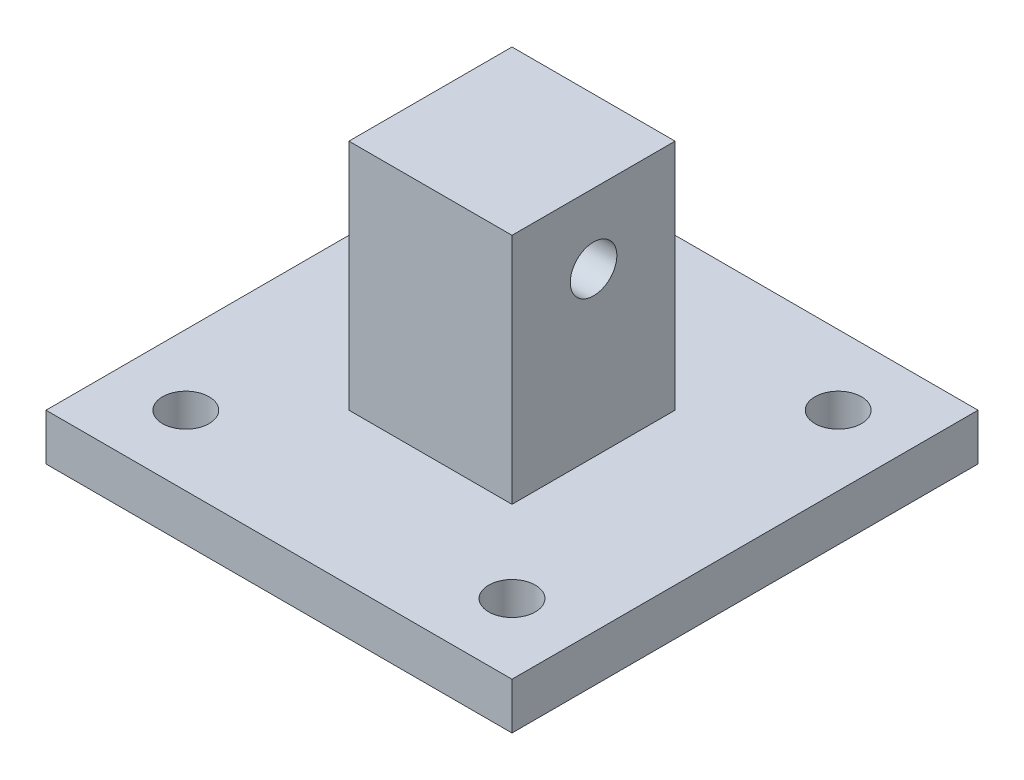
ISO-10303-21;
HEADER;
FILE_DESCRIPTION(('STEP AP214'),'2;1');
FILE_NAME('part.step','',(''),(''),'','','');
FILE_SCHEMA(('AUTOMOTIVE_DESIGN { 1 0 10303 214 1 1 1 1 }'));
ENDSEC;
DATA;
#1=APPLICATION_CONTEXT('core data for automotive mechanical design processes');
#2=APPLICATION_PROTOCOL_DEFINITION('international standard','automotive_design',2000,#1);
#3=PRODUCT_CONTEXT('',#1,'mechanical');
#4=PRODUCT('Part','Part','',(#3));
#5=PRODUCT_RELATED_PRODUCT_CATEGORY('part','',(#4));
#6=PRODUCT_DEFINITION_FORMATION('','',#4);
#7=PRODUCT_DEFINITION_CONTEXT('part definition',#1,'design');
#8=PRODUCT_DEFINITION('design','',#6,#7);
#9=PRODUCT_DEFINITION_SHAPE('','',#8);
#10=(LENGTH_UNIT() NAMED_UNIT(*) SI_UNIT(.MILLI.,.METRE.));
#11=(NAMED_UNIT(*) PLANE_ANGLE_UNIT() SI_UNIT($,.RADIAN.));
#12=(NAMED_UNIT(*) SI_UNIT($,.STERADIAN.) SOLID_ANGLE_UNIT());
#13=UNCERTAINTY_MEASURE_WITH_UNIT(LENGTH_MEASURE(1.E-05),#10,'distance_accuracy_value','');
#14=(GEOMETRIC_REPRESENTATION_CONTEXT(3) GLOBAL_UNCERTAINTY_ASSIGNED_CONTEXT((#13)) GLOBAL_UNIT_ASSIGNED_CONTEXT((#10,
#11,#12)) REPRESENTATION_CONTEXT('',''));
#15=CARTESIAN_POINT('',(0.,0.,0.));
#16=DIRECTION('',(0.,0.,1.));
#17=DIRECTION('',(1.,0.,0.));
#18=AXIS2_PLACEMENT_3D('',#15,#16,#17);
#19=CARTESIAN_POINT('',(0.,10.,0.));
#20=DIRECTION('',(0.,-1.,0.));
#21=DIRECTION('',(0.,0.,-1.));
#22=AXIS2_PLACEMENT_3D('',#19,#20,#21);
#23=PLANE('',#22);
#24=CARTESIAN_POINT('',(-35.,10.,35.));
#25=DIRECTION('',(0.,1.,0.));
#26=DIRECTION('',(0.,0.,1.));
#27=AXIS2_PLACEMENT_3D('',#24,#25,#26);
#28=CIRCLE('',#27,5.);
#29=CARTESIAN_POINT('',(-35.,10.,40.));
#30=VERTEX_POINT('',#29);
#31=EDGE_CURVE('E122',#30,#30,#28,.T.);
#32=ORIENTED_EDGE('',*,*,#31,.F.);
#33=EDGE_LOOP('',(#32));
#34=FACE_BOUND('',#33,.T.);
#35=CARTESIAN_POINT('',(35.,10.,-35.));
#36=DIRECTION('',(0.,1.,0.));
#37=DIRECTION('',(0.,0.,1.));
#38=AXIS2_PLACEMENT_3D('',#35,#36,#37);
#39=CIRCLE('',#38,5.);
#40=CARTESIAN_POINT('',(35.,10.,-30.));
#41=VERTEX_POINT('',#40);
#42=EDGE_CURVE('E137',#41,#41,#39,.T.);
#43=ORIENTED_EDGE('',*,*,#42,.F.);
#44=EDGE_LOOP('',(#43));
#45=FACE_BOUND('',#44,.T.);
#46=DIRECTION('',(0.,0.,-1.));
#47=VECTOR('',#46,1.);
#48=CARTESIAN_POINT('',(50.,10.,50.));
#49=LINE('',#48,#47);
#50=CARTESIAN_POINT('',(50.,10.,50.));
#51=VERTEX_POINT('',#50);
#52=CARTESIAN_POINT('',(50.,10.,-50.));
#53=VERTEX_POINT('',#52);
#54=EDGE_CURVE('E149',#51,#53,#49,.T.);
#55=ORIENTED_EDGE('',*,*,#54,.T.);
#56=DIRECTION('',(-1.,0.,0.));
#57=VECTOR('',#56,1.);
#58=CARTESIAN_POINT('',(-50.,10.,-50.));
#59=LINE('',#58,#57);
#60=CARTESIAN_POINT('',(-50.,10.,-50.));
#61=VERTEX_POINT('',#60);
#62=EDGE_CURVE('E152',#53,#61,#59,.T.);
#63=ORIENTED_EDGE('',*,*,#62,.T.);
#64=DIRECTION('',(0.,0.,1.));
#65=VECTOR('',#64,1.);
#66=CARTESIAN_POINT('',(-50.,10.,50.));
#67=LINE('',#66,#65);
#68=CARTESIAN_POINT('',(-50.,10.,50.));
#69=VERTEX_POINT('',#68);
#70=EDGE_CURVE('E155',#61,#69,#67,.T.);
#71=ORIENTED_EDGE('',*,*,#70,.T.);
#72=DIRECTION('',(1.,0.,0.));
#73=VECTOR('',#72,1.);
#74=CARTESIAN_POINT('',(-50.,10.,50.));
#75=LINE('',#74,#73);
#76=EDGE_CURVE('E157',#69,#51,#75,.T.);
#77=ORIENTED_EDGE('',*,*,#76,.T.);
#78=EDGE_LOOP('',(#55,#63,#71,#77));
#79=FACE_BOUND('',#78,.T.);
#80=CARTESIAN_POINT('',(-35.,10.,-35.));
#81=DIRECTION('',(0.,1.,0.));
#82=DIRECTION('',(0.,0.,1.));
#83=AXIS2_PLACEMENT_3D('',#80,#81,#82);
#84=CIRCLE('',#83,5.);
#85=CARTESIAN_POINT('',(-35.,10.,-30.));
#86=VERTEX_POINT('',#85);
#87=EDGE_CURVE('E143',#86,#86,#84,.T.);
#88=ORIENTED_EDGE('',*,*,#87,.F.);
#89=EDGE_LOOP('',(#88));
#90=FACE_BOUND('',#89,.T.);
#91=CARTESIAN_POINT('',(35.,10.,35.));
#92=DIRECTION('',(0.,1.,0.));
#93=DIRECTION('',(0.,0.,1.));
#94=AXIS2_PLACEMENT_3D('',#91,#92,#93);
#95=CIRCLE('',#94,5.);
#96=CARTESIAN_POINT('',(35.,10.,40.));
#97=VERTEX_POINT('',#96);
#98=EDGE_CURVE('E131',#97,#97,#95,.T.);
#99=ORIENTED_EDGE('',*,*,#98,.F.);
#100=EDGE_LOOP('',(#99));
#101=FACE_BOUND('',#100,.T.);
#102=DIRECTION('',(0.,0.,-1.));
#103=VECTOR('',#102,1.);
#104=CARTESIAN_POINT('',(17.5,10.,17.5));
#105=LINE('',#104,#103);
#106=CARTESIAN_POINT('',(17.5,10.,17.5));
#107=VERTEX_POINT('',#106);
#108=CARTESIAN_POINT('',(17.5,10.,-17.5));
#109=VERTEX_POINT('',#108);
#110=EDGE_CURVE('E118',#107,#109,#105,.T.);
#111=ORIENTED_EDGE('',*,*,#110,.F.);
#112=DIRECTION('',(1.,0.,0.));
#113=VECTOR('',#112,1.);
#114=CARTESIAN_POINT('',(-17.5,10.,17.5));
#115=LINE('',#114,#113);
#116=CARTESIAN_POINT('',(-17.5,10.,17.5));
#117=VERTEX_POINT('',#116);
#118=EDGE_CURVE('E115',#117,#107,#115,.T.);
#119=ORIENTED_EDGE('',*,*,#118,.F.);
#120=DIRECTION('',(0.,0.,1.));
#121=VECTOR('',#120,1.);
#122=CARTESIAN_POINT('',(-17.5,10.,17.5));
#123=LINE('',#122,#121);
#124=CARTESIAN_POINT('',(-17.5,10.,-17.5));
#125=VERTEX_POINT('',#124);
#126=EDGE_CURVE('E53',#125,#117,#123,.T.);
#127=ORIENTED_EDGE('',*,*,#126,.F.);
#128=DIRECTION('',(-1.,0.,0.));
#129=VECTOR('',#128,1.);
#130=CARTESIAN_POINT('',(-17.5,10.,-17.5));
#131=LINE('',#130,#129);
#132=EDGE_CURVE('E48',#109,#125,#131,.T.);
#133=ORIENTED_EDGE('',*,*,#132,.F.);
#134=EDGE_LOOP('',(#111,#119,#127,#133));
#135=FACE_BOUND('',#134,.T.);
#136=ADVANCED_FACE('F32',(#34,#45,#79,#90,#101,#135),#23,.F.);
#137=CARTESIAN_POINT('',(0.,0.,0.));
#138=DIRECTION('',(0.,-1.,0.));
#139=DIRECTION('',(0.,0.,-1.));
#140=AXIS2_PLACEMENT_3D('',#137,#138,#139);
#141=PLANE('',#140);
#142=CARTESIAN_POINT('',(35.,0.,35.));
#143=DIRECTION('',(0.,1.,0.));
#144=DIRECTION('',(0.,0.,1.));
#145=AXIS2_PLACEMENT_3D('',#142,#143,#144);
#146=CIRCLE('',#145,5.);
#147=CARTESIAN_POINT('',(35.,0.,40.));
#148=VERTEX_POINT('',#147);
#149=EDGE_CURVE('E129',#148,#148,#146,.T.);
#150=ORIENTED_EDGE('',*,*,#149,.T.);
#151=EDGE_LOOP('',(#150));
#152=FACE_BOUND('',#151,.T.);
#153=CARTESIAN_POINT('',(-35.,0.,-35.));
#154=DIRECTION('',(0.,1.,0.));
#155=DIRECTION('',(0.,0.,1.));
#156=AXIS2_PLACEMENT_3D('',#153,#154,#155);
#157=CIRCLE('',#156,5.);
#158=CARTESIAN_POINT('',(-35.,0.,-30.));
#159=VERTEX_POINT('',#158);
#160=EDGE_CURVE('E140',#159,#159,#157,.T.);
#161=ORIENTED_EDGE('',*,*,#160,.T.);
#162=EDGE_LOOP('',(#161));
#163=FACE_BOUND('',#162,.T.);
#164=DIRECTION('',(0.,0.,-1.));
#165=VECTOR('',#164,1.);
#166=CARTESIAN_POINT('',(50.,0.,50.));
#167=LINE('',#166,#165);
#168=CARTESIAN_POINT('',(50.,0.,50.));
#169=VERTEX_POINT('',#168);
#170=CARTESIAN_POINT('',(50.,0.,-50.));
#171=VERTEX_POINT('',#170);
#172=EDGE_CURVE('E146',#169,#171,#167,.T.);
#173=ORIENTED_EDGE('',*,*,#172,.F.);
#174=DIRECTION('',(1.,0.,0.));
#175=VECTOR('',#174,1.);
#176=CARTESIAN_POINT('',(-50.,0.,50.));
#177=LINE('',#176,#175);
#178=CARTESIAN_POINT('',(-50.,0.,50.));
#179=VERTEX_POINT('',#178);
#180=EDGE_CURVE('E153',#179,#169,#177,.T.);
#181=ORIENTED_EDGE('',*,*,#180,.F.);
#182=DIRECTION('',(0.,0.,1.));
#183=VECTOR('',#182,1.);
#184=CARTESIAN_POINT('',(-50.,0.,50.));
#185=LINE('',#184,#183);
#186=CARTESIAN_POINT('',(-50.,0.,-50.));
#187=VERTEX_POINT('',#186);
#188=EDGE_CURVE('E164',#187,#179,#185,.T.);
#189=ORIENTED_EDGE('',*,*,#188,.F.);
#190=DIRECTION('',(-1.,0.,0.));
#191=VECTOR('',#190,1.);
#192=CARTESIAN_POINT('',(-50.,0.,-50.));
#193=LINE('',#192,#191);
#194=EDGE_CURVE('E162',#171,#187,#193,.T.);
#195=ORIENTED_EDGE('',*,*,#194,.F.);
#196=EDGE_LOOP('',(#173,#181,#189,#195));
#197=FACE_BOUND('',#196,.T.);
#198=CARTESIAN_POINT('',(35.,0.,-35.));
#199=DIRECTION('',(0.,1.,0.));
#200=DIRECTION('',(0.,0.,1.));
#201=AXIS2_PLACEMENT_3D('',#198,#199,#200);
#202=CIRCLE('',#201,5.);
#203=CARTESIAN_POINT('',(35.,0.,-30.));
#204=VERTEX_POINT('',#203);
#205=EDGE_CURVE('E134',#204,#204,#202,.T.);
#206=ORIENTED_EDGE('',*,*,#205,.T.);
#207=EDGE_LOOP('',(#206));
#208=FACE_BOUND('',#207,.T.);
#209=CARTESIAN_POINT('',(-35.,0.,35.));
#210=DIRECTION('',(0.,1.,0.));
#211=DIRECTION('',(0.,0.,1.));
#212=AXIS2_PLACEMENT_3D('',#209,#210,#211);
#213=CIRCLE('',#212,5.);
#214=CARTESIAN_POINT('',(-35.,0.,40.));
#215=VERTEX_POINT('',#214);
#216=EDGE_CURVE('E119',#215,#215,#213,.T.);
#217=ORIENTED_EDGE('',*,*,#216,.T.);
#218=EDGE_LOOP('',(#217));
#219=FACE_BOUND('',#218,.T.);
#220=ADVANCED_FACE('F183',(#152,#163,#197,#208,#219),#141,.T.);
#221=CARTESIAN_POINT('',(50.,10.,50.));
#222=DIRECTION('',(-1.,0.,0.));
#223=DIRECTION('',(0.,0.,1.));
#224=AXIS2_PLACEMENT_3D('',#221,#222,#223);
#225=PLANE('',#224);
#226=ORIENTED_EDGE('',*,*,#172,.T.);
#227=DIRECTION('',(0.,-1.,0.));
#228=VECTOR('',#227,1.);
#229=CARTESIAN_POINT('',(50.,10.,-50.));
#230=LINE('',#229,#228);
#231=EDGE_CURVE('E11',#53,#171,#230,.T.);
#232=ORIENTED_EDGE('',*,*,#231,.F.);
#233=ORIENTED_EDGE('',*,*,#54,.F.);
#234=DIRECTION('',(0.,-1.,0.));
#235=VECTOR('',#234,1.);
#236=CARTESIAN_POINT('',(50.,10.,50.));
#237=LINE('',#236,#235);
#238=EDGE_CURVE('E159',#51,#169,#237,.T.);
#239=ORIENTED_EDGE('',*,*,#238,.T.);
#240=EDGE_LOOP('',(#226,#232,#233,#239));
#241=FACE_BOUND('',#240,.T.);
#242=ADVANCED_FACE('F34',(#241),#225,.F.);
#243=CARTESIAN_POINT('',(-50.,10.,-50.));
#244=DIRECTION('',(0.,0.,1.));
#245=DIRECTION('',(1.,0.,0.));
#246=AXIS2_PLACEMENT_3D('',#243,#244,#245);
#247=PLANE('',#246);
#248=ORIENTED_EDGE('',*,*,#194,.T.);
#249=DIRECTION('',(0.,-1.,0.));
#250=VECTOR('',#249,1.);
#251=CARTESIAN_POINT('',(-50.,10.,-50.));
#252=LINE('',#251,#250);
#253=EDGE_CURVE('E41',#61,#187,#252,.T.);
#254=ORIENTED_EDGE('',*,*,#253,.F.);
#255=ORIENTED_EDGE('',*,*,#62,.F.);
#256=ORIENTED_EDGE('',*,*,#231,.T.);
#257=EDGE_LOOP('',(#248,#254,#255,#256));
#258=FACE_BOUND('',#257,.T.);
#259=ADVANCED_FACE('F194',(#258),#247,.F.);
#260=CARTESIAN_POINT('',(-50.,10.,50.));
#261=DIRECTION('',(1.,0.,0.));
#262=DIRECTION('',(0.,0.,-1.));
#263=AXIS2_PLACEMENT_3D('',#260,#261,#262);
#264=PLANE('',#263);
#265=ORIENTED_EDGE('',*,*,#188,.T.);
#266=DIRECTION('',(0.,-1.,0.));
#267=VECTOR('',#266,1.);
#268=CARTESIAN_POINT('',(-50.,10.,50.));
#269=LINE('',#268,#267);
#270=EDGE_CURVE('E169',#69,#179,#269,.T.);
#271=ORIENTED_EDGE('',*,*,#270,.F.);
#272=ORIENTED_EDGE('',*,*,#70,.F.);
#273=ORIENTED_EDGE('',*,*,#253,.T.);
#274=EDGE_LOOP('',(#265,#271,#272,#273));
#275=FACE_BOUND('',#274,.T.);
#276=ADVANCED_FACE('F177',(#275),#264,.F.);
#277=CARTESIAN_POINT('',(-50.,10.,50.));
#278=DIRECTION('',(0.,0.,-1.));
#279=DIRECTION('',(-1.,0.,0.));
#280=AXIS2_PLACEMENT_3D('',#277,#278,#279);
#281=PLANE('',#280);
#282=ORIENTED_EDGE('',*,*,#180,.T.);
#283=ORIENTED_EDGE('',*,*,#238,.F.);
#284=ORIENTED_EDGE('',*,*,#76,.F.);
#285=ORIENTED_EDGE('',*,*,#270,.T.);
#286=EDGE_LOOP('',(#282,#283,#284,#285));
#287=FACE_BOUND('',#286,.T.);
#288=ADVANCED_FACE('F187',(#287),#281,.F.);
#289=CARTESIAN_POINT('',(-35.,10.,-35.));
#290=DIRECTION('',(0.,-1.,0.));
#291=DIRECTION('',(0.,0.,-1.));
#292=AXIS2_PLACEMENT_3D('',#289,#290,#291);
#293=CYLINDRICAL_SURFACE('',#292,5.);
#294=ORIENTED_EDGE('',*,*,#87,.T.);
#295=EDGE_LOOP('',(#294));
#296=FACE_BOUND('',#295,.T.);
#297=ORIENTED_EDGE('',*,*,#160,.F.);
#298=EDGE_LOOP('',(#297));
#299=FACE_BOUND('',#298,.T.);
#300=ADVANCED_FACE('F212',(#296,#299),#293,.F.);
#301=CARTESIAN_POINT('',(35.,10.,-35.));
#302=DIRECTION('',(0.,-1.,0.));
#303=DIRECTION('',(0.,0.,-1.));
#304=AXIS2_PLACEMENT_3D('',#301,#302,#303);
#305=CYLINDRICAL_SURFACE('',#304,5.);
#306=ORIENTED_EDGE('',*,*,#42,.T.);
#307=EDGE_LOOP('',(#306));
#308=FACE_BOUND('',#307,.T.);
#309=ORIENTED_EDGE('',*,*,#205,.F.);
#310=EDGE_LOOP('',(#309));
#311=FACE_BOUND('',#310,.T.);
#312=ADVANCED_FACE('F219',(#308,#311),#305,.F.);
#313=CARTESIAN_POINT('',(35.,10.,35.));
#314=DIRECTION('',(0.,-1.,0.));
#315=DIRECTION('',(0.,0.,-1.));
#316=AXIS2_PLACEMENT_3D('',#313,#314,#315);
#317=CYLINDRICAL_SURFACE('',#316,5.);
#318=ORIENTED_EDGE('',*,*,#98,.T.);
#319=EDGE_LOOP('',(#318));
#320=FACE_BOUND('',#319,.T.);
#321=ORIENTED_EDGE('',*,*,#149,.F.);
#322=EDGE_LOOP('',(#321));
#323=FACE_BOUND('',#322,.T.);
#324=ADVANCED_FACE('F224',(#320,#323),#317,.F.);
#325=CARTESIAN_POINT('',(-35.,10.,35.));
#326=DIRECTION('',(0.,-1.,0.));
#327=DIRECTION('',(0.,0.,-1.));
#328=AXIS2_PLACEMENT_3D('',#325,#326,#327);
#329=CYLINDRICAL_SURFACE('',#328,5.);
#330=ORIENTED_EDGE('',*,*,#31,.T.);
#331=EDGE_LOOP('',(#330));
#332=FACE_BOUND('',#331,.T.);
#333=ORIENTED_EDGE('',*,*,#216,.F.);
#334=EDGE_LOOP('',(#333));
#335=FACE_BOUND('',#334,.T.);
#336=ADVANCED_FACE('F273',(#332,#335),#329,.F.);
#337=CARTESIAN_POINT('',(17.5,60.,17.5));
#338=DIRECTION('',(-1.,0.,0.));
#339=DIRECTION('',(0.,0.,1.));
#340=AXIS2_PLACEMENT_3D('',#337,#338,#339);
#341=PLANE('',#340);
#342=CARTESIAN_POINT('',(17.5,45.,0.));
#343=DIRECTION('',(-1.,0.,0.));
#344=DIRECTION('',(0.,0.,1.));
#345=AXIS2_PLACEMENT_3D('',#342,#343,#344);
#346=CIRCLE('',#345,5.);
#347=CARTESIAN_POINT('',(17.5,45.,5.));
#348=VERTEX_POINT('',#347);
#349=EDGE_CURVE('E233',#348,#348,#346,.T.);
#350=ORIENTED_EDGE('',*,*,#349,.T.);
#351=EDGE_LOOP('',(#350));
#352=FACE_BOUND('',#351,.T.);
#353=ORIENTED_EDGE('',*,*,#110,.T.);
#354=DIRECTION('',(0.,-1.,0.));
#355=VECTOR('',#354,1.);
#356=CARTESIAN_POINT('',(17.5,60.,-17.5));
#357=LINE('',#356,#355);
#358=CARTESIAN_POINT('',(17.5,60.,-17.5));
#359=VERTEX_POINT('',#358);
#360=EDGE_CURVE('E99',#359,#109,#357,.T.);
#361=ORIENTED_EDGE('',*,*,#360,.F.);
#362=DIRECTION('',(0.,0.,-1.));
#363=VECTOR('',#362,1.);
#364=CARTESIAN_POINT('',(17.5,60.,17.5));
#365=LINE('',#364,#363);
#366=CARTESIAN_POINT('',(17.5,60.,17.5));
#367=VERTEX_POINT('',#366);
#368=EDGE_CURVE('E106',#367,#359,#365,.T.);
#369=ORIENTED_EDGE('',*,*,#368,.F.);
#370=DIRECTION('',(0.,-1.,0.));
#371=VECTOR('',#370,1.);
#372=CARTESIAN_POINT('',(17.5,60.,17.5));
#373=LINE('',#372,#371);
#374=EDGE_CURVE('E238',#367,#107,#373,.T.);
#375=ORIENTED_EDGE('',*,*,#374,.T.);
#376=EDGE_LOOP('',(#353,#361,#369,#375));
#377=FACE_BOUND('',#376,.T.);
#378=ADVANCED_FACE('F117',(#352,#377),#341,.F.);
#379=CARTESIAN_POINT('',(-17.5,60.,-17.5));
#380=DIRECTION('',(0.,0.,1.));
#381=DIRECTION('',(1.,0.,0.));
#382=AXIS2_PLACEMENT_3D('',#379,#380,#381);
#383=PLANE('',#382);
#384=ORIENTED_EDGE('',*,*,#132,.T.);
#385=DIRECTION('',(0.,-1.,0.));
#386=VECTOR('',#385,1.);
#387=CARTESIAN_POINT('',(-17.5,60.,-17.5));
#388=LINE('',#387,#386);
#389=CARTESIAN_POINT('',(-17.5,60.,-17.5));
#390=VERTEX_POINT('',#389);
#391=EDGE_CURVE('E102',#390,#125,#388,.T.);
#392=ORIENTED_EDGE('',*,*,#391,.F.);
#393=DIRECTION('',(-1.,0.,0.));
#394=VECTOR('',#393,1.);
#395=CARTESIAN_POINT('',(-17.5,60.,-17.5));
#396=LINE('',#395,#394);
#397=EDGE_CURVE('E95',#359,#390,#396,.T.);
#398=ORIENTED_EDGE('',*,*,#397,.F.);
#399=ORIENTED_EDGE('',*,*,#360,.T.);
#400=EDGE_LOOP('',(#384,#392,#398,#399));
#401=FACE_BOUND('',#400,.T.);
#402=ADVANCED_FACE('F97',(#401),#383,.F.);
#403=CARTESIAN_POINT('',(-17.5,60.,17.5));
#404=DIRECTION('',(1.,0.,0.));
#405=DIRECTION('',(0.,0.,-1.));
#406=AXIS2_PLACEMENT_3D('',#403,#404,#405);
#407=PLANE('',#406);
#408=CARTESIAN_POINT('',(-17.5,45.,0.));
#409=DIRECTION('',(1.,0.,0.));
#410=DIRECTION('',(0.,0.,-1.));
#411=AXIS2_PLACEMENT_3D('',#408,#409,#410);
#412=CIRCLE('',#411,5.);
#413=CARTESIAN_POINT('',(-17.5,45.,-5.));
#414=VERTEX_POINT('',#413);
#415=EDGE_CURVE('E36',#414,#414,#412,.T.);
#416=ORIENTED_EDGE('',*,*,#415,.T.);
#417=EDGE_LOOP('',(#416));
#418=FACE_BOUND('',#417,.T.);
#419=ORIENTED_EDGE('',*,*,#126,.T.);
#420=DIRECTION('',(0.,-1.,0.));
#421=VECTOR('',#420,1.);
#422=CARTESIAN_POINT('',(-17.5,60.,17.5));
#423=LINE('',#422,#421);
#424=CARTESIAN_POINT('',(-17.5,60.,17.5));
#425=VERTEX_POINT('',#424);
#426=EDGE_CURVE('E124',#425,#117,#423,.T.);
#427=ORIENTED_EDGE('',*,*,#426,.F.);
#428=DIRECTION('',(0.,0.,1.));
#429=VECTOR('',#428,1.);
#430=CARTESIAN_POINT('',(-17.5,60.,17.5));
#431=LINE('',#430,#429);
#432=EDGE_CURVE('E105',#390,#425,#431,.T.);
#433=ORIENTED_EDGE('',*,*,#432,.F.);
#434=ORIENTED_EDGE('',*,*,#391,.T.);
#435=EDGE_LOOP('',(#419,#427,#433,#434));
#436=FACE_BOUND('',#435,.T.);
#437=ADVANCED_FACE('F253',(#418,#436),#407,.F.);
#438=CARTESIAN_POINT('',(-17.5,60.,17.5));
#439=DIRECTION('',(0.,0.,-1.));
#440=DIRECTION('',(-1.,0.,0.));
#441=AXIS2_PLACEMENT_3D('',#438,#439,#440);
#442=PLANE('',#441);
#443=ORIENTED_EDGE('',*,*,#118,.T.);
#444=ORIENTED_EDGE('',*,*,#374,.F.);
#445=DIRECTION('',(1.,0.,0.));
#446=VECTOR('',#445,1.);
#447=CARTESIAN_POINT('',(-17.5,60.,17.5));
#448=LINE('',#447,#446);
#449=EDGE_CURVE('E111',#425,#367,#448,.T.);
#450=ORIENTED_EDGE('',*,*,#449,.F.);
#451=ORIENTED_EDGE('',*,*,#426,.T.);
#452=EDGE_LOOP('',(#443,#444,#450,#451));
#453=FACE_BOUND('',#452,.T.);
#454=ADVANCED_FACE('F237',(#453),#442,.F.);
#455=CARTESIAN_POINT('',(0.,60.,0.));
#456=DIRECTION('',(0.,-1.,0.));
#457=DIRECTION('',(0.,0.,-1.));
#458=AXIS2_PLACEMENT_3D('',#455,#456,#457);
#459=PLANE('',#458);
#460=ORIENTED_EDGE('',*,*,#368,.T.);
#461=ORIENTED_EDGE('',*,*,#397,.T.);
#462=ORIENTED_EDGE('',*,*,#432,.T.);
#463=ORIENTED_EDGE('',*,*,#449,.T.);
#464=EDGE_LOOP('',(#460,#461,#462,#463));
#465=FACE_BOUND('',#464,.T.);
#466=ADVANCED_FACE('F109',(#465),#459,.F.);
#467=CARTESIAN_POINT('',(-50.,45.,0.));
#468=DIRECTION('',(1.,0.,0.));
#469=DIRECTION('',(0.,0.,-1.));
#470=AXIS2_PLACEMENT_3D('',#467,#468,#469);
#471=CYLINDRICAL_SURFACE('',#470,5.);
#472=ORIENTED_EDGE('',*,*,#415,.F.);
#473=EDGE_LOOP('',(#472));
#474=FACE_BOUND('',#473,.T.);
#475=ORIENTED_EDGE('',*,*,#349,.F.);
#476=EDGE_LOOP('',(#475));
#477=FACE_BOUND('',#476,.T.);
#478=ADVANCED_FACE('F256',(#474,#477),#471,.F.);
#479=CLOSED_SHELL('',(#136,#220,#242,#259,#276,#288,#300,#312,#324,#336,#378,#402,#437,#454,
#466,#478));
#480=MANIFOLD_SOLID_BREP('B2',#479);
#481=ADVANCED_BREP_SHAPE_REPRESENTATION('',(#18,#480),#14);
#482=SHAPE_DEFINITION_REPRESENTATION(#9,#481);
ENDSEC;
END-ISO-10303-21;
